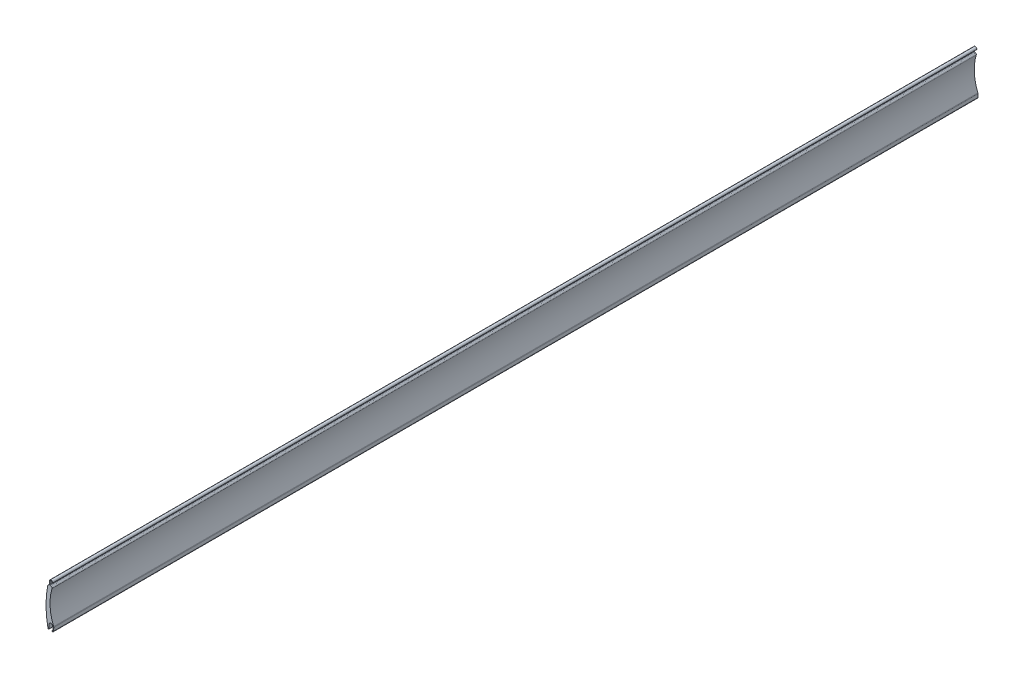
ISO-10303-21;
HEADER;
FILE_DESCRIPTION(('STEP AP214'),'2;1');
FILE_NAME('part.step','',(''),(''),'','','');
FILE_SCHEMA(('AUTOMOTIVE_DESIGN { 1 0 10303 214 1 1 1 1 }'));
ENDSEC;
DATA;
#1=APPLICATION_CONTEXT('core data for automotive mechanical design processes');
#2=APPLICATION_PROTOCOL_DEFINITION('international standard','automotive_design',2000,#1);
#3=PRODUCT_CONTEXT('',#1,'mechanical');
#4=PRODUCT('Part','Part','',(#3));
#5=PRODUCT_RELATED_PRODUCT_CATEGORY('part','',(#4));
#6=PRODUCT_DEFINITION_FORMATION('','',#4);
#7=PRODUCT_DEFINITION_CONTEXT('part definition',#1,'design');
#8=PRODUCT_DEFINITION('design','',#6,#7);
#9=PRODUCT_DEFINITION_SHAPE('','',#8);
#10=(LENGTH_UNIT() NAMED_UNIT(*) SI_UNIT(.MILLI.,.METRE.));
#11=(NAMED_UNIT(*) PLANE_ANGLE_UNIT() SI_UNIT($,.RADIAN.));
#12=(NAMED_UNIT(*) SI_UNIT($,.STERADIAN.) SOLID_ANGLE_UNIT());
#13=UNCERTAINTY_MEASURE_WITH_UNIT(LENGTH_MEASURE(1.E-05),#10,'distance_accuracy_value','');
#14=(GEOMETRIC_REPRESENTATION_CONTEXT(3) GLOBAL_UNCERTAINTY_ASSIGNED_CONTEXT((#13)) GLOBAL_UNIT_ASSIGNED_CONTEXT((#10,
#11,#12)) REPRESENTATION_CONTEXT('',''));
#15=CARTESIAN_POINT('',(0.,0.,0.));
#16=DIRECTION('',(0.,0.,1.));
#17=DIRECTION('',(1.,0.,0.));
#18=AXIS2_PLACEMENT_3D('',#15,#16,#17);
#19=CARTESIAN_POINT('',(-1.24379451788858,-0.477095883177836,-885.));
#20=DIRECTION('',(0.,0.,1.));
#21=DIRECTION('',(1.,0.,0.));
#22=AXIS2_PLACEMENT_3D('',#19,#20,#21);
#23=CYLINDRICAL_SURFACE('',#22,0.535894472984347);
#24=CARTESIAN_POINT('',(-1.24379451788858,-0.477095883177836,0.));
#25=DIRECTION('',(0.,0.,1.));
#26=DIRECTION('',(1.,0.,0.));
#27=AXIS2_PLACEMENT_3D('',#24,#25,#26);
#28=CIRCLE('',#27,0.535894472984347);
#29=CARTESIAN_POINT('',(-1.76840947033643,-0.586466984677828,0.));
#30=VERTEX_POINT('',#29);
#31=CARTESIAN_POINT('',(-0.708129005284427,-0.492759368795541,0.));
#32=VERTEX_POINT('',#31);
#33=EDGE_CURVE('E271',#30,#32,#28,.T.);
#34=ORIENTED_EDGE('',*,*,#33,.F.);
#35=DIRECTION('',(0.,0.,1.));
#36=VECTOR('',#35,1.);
#37=CARTESIAN_POINT('',(-1.76840947033643,-0.586466984677828,-885.));
#38=LINE('',#37,#36);
#39=CARTESIAN_POINT('',(-1.76840947033643,-0.586466984677828,-885.));
#40=VERTEX_POINT('',#39);
#41=EDGE_CURVE('E44',#40,#30,#38,.T.);
#42=ORIENTED_EDGE('',*,*,#41,.F.);
#43=CARTESIAN_POINT('',(-1.24379451788858,-0.477095883177836,-885.));
#44=DIRECTION('',(0.,0.,1.));
#45=DIRECTION('',(1.,0.,0.));
#46=AXIS2_PLACEMENT_3D('',#43,#44,#45);
#47=CIRCLE('',#46,0.535894472984347);
#48=CARTESIAN_POINT('',(-0.708129005284427,-0.492759368795541,-885.));
#49=VERTEX_POINT('',#48);
#50=EDGE_CURVE('E214',#40,#49,#47,.T.);
#51=ORIENTED_EDGE('',*,*,#50,.T.);
#52=DIRECTION('',(0.,0.,1.));
#53=VECTOR('',#52,1.);
#54=CARTESIAN_POINT('',(-0.708129005284427,-0.492759368795541,-885.));
#55=LINE('',#54,#53);
#56=EDGE_CURVE('E11',#49,#32,#55,.T.);
#57=ORIENTED_EDGE('',*,*,#56,.T.);
#58=EDGE_LOOP('',(#34,#42,#51,#57));
#59=FACE_BOUND('',#58,.T.);
#60=ADVANCED_FACE('F35',(#59),#23,.T.);
#61=CARTESIAN_POINT('',(86.0633469853701,17.7240086702681,-885.));
#62=DIRECTION('',(0.,0.,1.));
#63=DIRECTION('',(1.,0.,0.));
#64=AXIS2_PLACEMENT_3D('',#61,#62,#63);
#65=CYLINDRICAL_SURFACE('',#64,89.7200700000001);
#66=CARTESIAN_POINT('',(86.0633469853701,17.7240086702681,0.));
#67=DIRECTION('',(0.,0.,1.));
#68=DIRECTION('',(1.,0.,0.));
#69=AXIS2_PLACEMENT_3D('',#66,#67,#68);
#70=CIRCLE('',#69,89.7200700000001);
#71=CARTESIAN_POINT('',(-1.98617167665066,34.9569197473721,0.));
#72=VERTEX_POINT('',#71);
#73=EDGE_CURVE('E268',#72,#30,#70,.T.);
#74=ORIENTED_EDGE('',*,*,#73,.F.);
#75=DIRECTION('',(0.,0.,1.));
#76=VECTOR('',#75,1.);
#77=CARTESIAN_POINT('',(-1.98617167665066,34.9569197473721,-885.));
#78=LINE('',#77,#76);
#79=CARTESIAN_POINT('',(-1.98617167665066,34.9569197473721,-885.));
#80=VERTEX_POINT('',#79);
#81=EDGE_CURVE('E193',#80,#72,#78,.T.);
#82=ORIENTED_EDGE('',*,*,#81,.F.);
#83=CARTESIAN_POINT('',(86.0633469853701,17.7240086702681,-885.));
#84=DIRECTION('',(0.,0.,1.));
#85=DIRECTION('',(1.,0.,0.));
#86=AXIS2_PLACEMENT_3D('',#83,#84,#85);
#87=CIRCLE('',#86,89.7200700000001);
#88=EDGE_CURVE('E204',#80,#40,#87,.T.);
#89=ORIENTED_EDGE('',*,*,#88,.T.);
#90=ORIENTED_EDGE('',*,*,#41,.T.);
#91=EDGE_LOOP('',(#74,#82,#89,#90));
#92=FACE_BOUND('',#91,.T.);
#93=ADVANCED_FACE('F484',(#92),#65,.T.);
#94=CARTESIAN_POINT('',(-1.39734343266762,34.8416752286778,-885.));
#95=DIRECTION('',(0.,0.,1.));
#96=DIRECTION('',(1.,0.,0.));
#97=AXIS2_PLACEMENT_3D('',#94,#95,#96);
#98=CYLINDRICAL_SURFACE('',#97,0.600000000000614);
#99=CARTESIAN_POINT('',(-1.39734343266762,34.8416752286778,0.));
#100=DIRECTION('',(0.,0.,1.));
#101=DIRECTION('',(1.,0.,0.));
#102=AXIS2_PLACEMENT_3D('',#99,#100,#101);
#103=CIRCLE('',#102,0.600000000000614);
#104=CARTESIAN_POINT('',(-1.58598815489791,35.4112480236526,0.));
#105=VERTEX_POINT('',#104);
#106=EDGE_CURVE('E188',#105,#72,#103,.T.);
#107=ORIENTED_EDGE('',*,*,#106,.F.);
#108=DIRECTION('',(0.,0.,1.));
#109=VECTOR('',#108,1.);
#110=CARTESIAN_POINT('',(-1.58598815489791,35.4112480236526,-885.));
#111=LINE('',#110,#109);
#112=CARTESIAN_POINT('',(-1.58598815489791,35.4112480236526,-885.));
#113=VERTEX_POINT('',#112);
#114=EDGE_CURVE('E183',#113,#105,#111,.T.);
#115=ORIENTED_EDGE('',*,*,#114,.F.);
#116=CARTESIAN_POINT('',(-1.39734343266762,34.8416752286778,-885.));
#117=DIRECTION('',(0.,0.,1.));
#118=DIRECTION('',(1.,0.,0.));
#119=AXIS2_PLACEMENT_3D('',#116,#117,#118);
#120=CIRCLE('',#119,0.600000000000614);
#121=EDGE_CURVE('E186',#113,#80,#120,.T.);
#122=ORIENTED_EDGE('',*,*,#121,.T.);
#123=ORIENTED_EDGE('',*,*,#81,.T.);
#124=EDGE_LOOP('',(#107,#115,#122,#123));
#125=FACE_BOUND('',#124,.T.);
#126=ADVANCED_FACE('F185',(#125),#98,.T.);
#127=CARTESIAN_POINT('',(-1.58598815489778,35.4112480236522,-885.));
#128=DIRECTION('',(-0.314406715035243,0.949288374278726,0.));
#129=DIRECTION('',(-0.949288374278726,-0.314406715035243,0.));
#130=AXIS2_PLACEMENT_3D('',#127,#128,#129);
#131=PLANE('',#130);
#132=DIRECTION('',(-0.949288374278726,-0.314406715035243,0.));
#133=VECTOR('',#132,1.);
#134=CARTESIAN_POINT('',(-1.58598815489778,35.4112480236522,0.));
#135=LINE('',#134,#133);
#136=CARTESIAN_POINT('',(-1.04469942193401,35.5905242236226,0.));
#137=VERTEX_POINT('',#136);
#138=EDGE_CURVE('E265',#137,#105,#135,.T.);
#139=ORIENTED_EDGE('',*,*,#138,.F.);
#140=DIRECTION('',(0.,0.,1.));
#141=VECTOR('',#140,1.);
#142=CARTESIAN_POINT('',(-1.04469942193401,35.5905242236226,-885.));
#143=LINE('',#142,#141);
#144=CARTESIAN_POINT('',(-1.04469942193401,35.5905242236226,-885.));
#145=VERTEX_POINT('',#144);
#146=EDGE_CURVE('E194',#145,#137,#143,.T.);
#147=ORIENTED_EDGE('',*,*,#146,.F.);
#148=DIRECTION('',(-0.949288374278726,-0.314406715035243,0.));
#149=VECTOR('',#148,1.);
#150=CARTESIAN_POINT('',(-1.58598815489778,35.4112480236522,-885.));
#151=LINE('',#150,#149);
#152=EDGE_CURVE('E202',#145,#113,#151,.T.);
#153=ORIENTED_EDGE('',*,*,#152,.T.);
#154=ORIENTED_EDGE('',*,*,#114,.T.);
#155=EDGE_LOOP('',(#139,#147,#153,#154));
#156=FACE_BOUND('',#155,.T.);
#157=ADVANCED_FACE('F206',(#156),#131,.T.);
#158=CARTESIAN_POINT('',(-1.27695444942009,36.2917689431343,-885.));
#159=DIRECTION('',(0.,0.,1.));
#160=DIRECTION('',(1.,0.,0.));
#161=AXIS2_PLACEMENT_3D('',#158,#159,#160);
#162=CYLINDRICAL_SURFACE('',#161,0.738705999999331);
#163=CARTESIAN_POINT('',(-1.27695444942009,36.2917689431343,0.));
#164=DIRECTION('',(0.,0.,-1.));
#165=DIRECTION('',(1.,0.,0.));
#166=AXIS2_PLACEMENT_3D('',#163,#164,#165);
#167=CIRCLE('',#166,0.738705999999331);
#168=CARTESIAN_POINT('',(-0.538564027254849,36.2701786932598,0.));
#169=VERTEX_POINT('',#168);
#170=EDGE_CURVE('E262',#169,#137,#167,.T.);
#171=ORIENTED_EDGE('',*,*,#170,.F.);
#172=DIRECTION('',(0.,0.,1.));
#173=VECTOR('',#172,1.);
#174=CARTESIAN_POINT('',(-0.538564027254849,36.2701786932598,-885.));
#175=LINE('',#174,#173);
#176=CARTESIAN_POINT('',(-0.538564027254849,36.2701786932598,-885.));
#177=VERTEX_POINT('',#176);
#178=EDGE_CURVE('E278',#177,#169,#175,.T.);
#179=ORIENTED_EDGE('',*,*,#178,.F.);
#180=CARTESIAN_POINT('',(-1.27695444942009,36.2917689431343,-885.));
#181=DIRECTION('',(0.,0.,-1.));
#182=DIRECTION('',(1.,0.,0.));
#183=AXIS2_PLACEMENT_3D('',#180,#181,#182);
#184=CIRCLE('',#183,0.738705999999331);
#185=EDGE_CURVE('E207',#177,#145,#184,.T.);
#186=ORIENTED_EDGE('',*,*,#185,.T.);
#187=ORIENTED_EDGE('',*,*,#146,.T.);
#188=EDGE_LOOP('',(#171,#179,#186,#187));
#189=FACE_BOUND('',#188,.T.);
#190=ADVANCED_FACE('F486',(#189),#162,.F.);
#191=CARTESIAN_POINT('',(-0.538564027255268,36.2701786932598,-885.));
#192=DIRECTION('',(-0.999572740847055,0.029229022486317,0.));
#193=DIRECTION('',(-0.029229022486317,-0.999572740847055,0.));
#194=AXIS2_PLACEMENT_3D('',#191,#192,#193);
#195=PLANE('',#194);
#196=DIRECTION('',(-0.029229022486317,-0.999572740847055,0.));
#197=VECTOR('',#196,1.);
#198=CARTESIAN_POINT('',(-0.538564027255268,36.2701786932598,0.));
#199=LINE('',#198,#197);
#200=CARTESIAN_POINT('',(-0.44875936816689,39.3413142150799,0.));
#201=VERTEX_POINT('',#200);
#202=EDGE_CURVE('E259',#201,#169,#199,.T.);
#203=ORIENTED_EDGE('',*,*,#202,.F.);
#204=DIRECTION('',(0.,0.,1.));
#205=VECTOR('',#204,1.);
#206=CARTESIAN_POINT('',(-0.44875936816689,39.3413142150799,-885.));
#207=LINE('',#206,#205);
#208=CARTESIAN_POINT('',(-0.44875936816689,39.3413142150799,-885.));
#209=VERTEX_POINT('',#208);
#210=EDGE_CURVE('E280',#209,#201,#207,.T.);
#211=ORIENTED_EDGE('',*,*,#210,.F.);
#212=DIRECTION('',(-0.029229022486317,-0.999572740847055,0.));
#213=VECTOR('',#212,1.);
#214=CARTESIAN_POINT('',(-0.538564027255268,36.2701786932598,-885.));
#215=LINE('',#214,#213);
#216=EDGE_CURVE('E209',#209,#177,#215,.T.);
#217=ORIENTED_EDGE('',*,*,#216,.T.);
#218=ORIENTED_EDGE('',*,*,#178,.T.);
#219=EDGE_LOOP('',(#203,#211,#217,#218));
#220=FACE_BOUND('',#219,.T.);
#221=ADVANCED_FACE('F391',(#220),#195,.T.);
#222=CARTESIAN_POINT('',(1.15053552694845,39.2938134022761,-885.));
#223=DIRECTION('',(0.,0.,1.));
#224=DIRECTION('',(1.,0.,0.));
#225=AXIS2_PLACEMENT_3D('',#222,#223,#224);
#226=CYLINDRICAL_SURFACE('',#225,1.60000015273601);
#227=CARTESIAN_POINT('',(1.15053552694845,39.2938134022761,0.));
#228=DIRECTION('',(0.,0.,1.));
#229=DIRECTION('',(1.,0.,0.));
#230=AXIS2_PLACEMENT_3D('',#227,#228,#229);
#231=CIRCLE('',#230,1.60000015273601);
#232=CARTESIAN_POINT('',(2.74987336620641,39.2477811888497,0.));
#233=VERTEX_POINT('',#232);
#234=EDGE_CURVE('E256',#233,#201,#231,.T.);
#235=ORIENTED_EDGE('',*,*,#234,.F.);
#236=DIRECTION('',(0.,0.,1.));
#237=VECTOR('',#236,1.);
#238=CARTESIAN_POINT('',(2.74987336620641,39.2477811888497,-885.));
#239=LINE('',#238,#237);
#240=CARTESIAN_POINT('',(2.74987336620641,39.2477811888497,-885.));
#241=VERTEX_POINT('',#240);
#242=EDGE_CURVE('E282',#241,#233,#239,.T.);
#243=ORIENTED_EDGE('',*,*,#242,.F.);
#244=CARTESIAN_POINT('',(1.15053552694845,39.2938134022761,-885.));
#245=DIRECTION('',(0.,0.,1.));
#246=DIRECTION('',(1.,0.,0.));
#247=AXIS2_PLACEMENT_3D('',#244,#245,#246);
#248=CIRCLE('',#247,1.60000015273601);
#249=EDGE_CURVE('E385',#241,#209,#248,.T.);
#250=ORIENTED_EDGE('',*,*,#249,.T.);
#251=ORIENTED_EDGE('',*,*,#210,.T.);
#252=EDGE_LOOP('',(#235,#243,#250,#251));
#253=FACE_BOUND('',#252,.T.);
#254=ADVANCED_FACE('F397',(#253),#226,.T.);
#255=CARTESIAN_POINT('',(2.30006569853119,39.2609364957856,-885.));
#256=DIRECTION('',(0.,0.,1.));
#257=DIRECTION('',(1.,0.,0.));
#258=AXIS2_PLACEMENT_3D('',#255,#256,#257);
#259=CYLINDRICAL_SURFACE('',#258,0.449999999999965);
#260=CARTESIAN_POINT('',(2.30006569853119,39.2609364957856,0.));
#261=DIRECTION('',(0.,0.,1.));
#262=DIRECTION('',(1.,0.,0.));
#263=AXIS2_PLACEMENT_3D('',#260,#261,#262);
#264=CIRCLE('',#263,0.449999999999965);
#265=CARTESIAN_POINT('',(1.87808462843638,39.1046291815562,0.));
#266=VERTEX_POINT('',#265);
#267=EDGE_CURVE('E253',#266,#233,#264,.T.);
#268=ORIENTED_EDGE('',*,*,#267,.F.);
#269=DIRECTION('',(0.,0.,1.));
#270=VECTOR('',#269,1.);
#271=CARTESIAN_POINT('',(1.87808462843638,39.1046291815562,-885.));
#272=LINE('',#271,#270);
#273=CARTESIAN_POINT('',(1.87808462843638,39.1046291815562,-885.));
#274=VERTEX_POINT('',#273);
#275=EDGE_CURVE('E284',#274,#266,#272,.T.);
#276=ORIENTED_EDGE('',*,*,#275,.F.);
#277=CARTESIAN_POINT('',(2.30006569853119,39.2609364957856,-885.));
#278=DIRECTION('',(0.,0.,1.));
#279=DIRECTION('',(1.,0.,0.));
#280=AXIS2_PLACEMENT_3D('',#277,#278,#279);
#281=CIRCLE('',#280,0.449999999999965);
#282=EDGE_CURVE('E382',#274,#241,#281,.T.);
#283=ORIENTED_EDGE('',*,*,#282,.T.);
#284=ORIENTED_EDGE('',*,*,#242,.T.);
#285=EDGE_LOOP('',(#268,#276,#283,#284));
#286=FACE_BOUND('',#285,.T.);
#287=ADVANCED_FACE('F400',(#286),#259,.T.);
#288=CARTESIAN_POINT('',(1.87808462843531,39.1046291815558,-885.));
#289=DIRECTION('',(-0.50914796465507,0.860679005255501,0.));
#290=DIRECTION('',(-0.860679005255501,-0.509147964655071,0.));
#291=AXIS2_PLACEMENT_3D('',#288,#289,#290);
#292=PLANE('',#291);
#293=DIRECTION('',(-0.860679005255501,-0.509147964655071,0.));
#294=VECTOR('',#293,1.);
#295=CARTESIAN_POINT('',(1.87808462843531,39.1046291815558,0.));
#296=LINE('',#295,#294);
#297=CARTESIAN_POINT('',(2.14975363073907,39.2653391776615,0.));
#298=VERTEX_POINT('',#297);
#299=EDGE_CURVE('E250',#298,#266,#296,.T.);
#300=ORIENTED_EDGE('',*,*,#299,.F.);
#301=DIRECTION('',(0.,0.,1.));
#302=VECTOR('',#301,1.);
#303=CARTESIAN_POINT('',(2.14975363073907,39.2653391776615,-885.));
#304=LINE('',#303,#302);
#305=CARTESIAN_POINT('',(2.14975363073907,39.2653391776615,-885.));
#306=VERTEX_POINT('',#305);
#307=EDGE_CURVE('E286',#306,#298,#304,.T.);
#308=ORIENTED_EDGE('',*,*,#307,.F.);
#309=DIRECTION('',(-0.860679005255501,-0.509147964655071,0.));
#310=VECTOR('',#309,1.);
#311=CARTESIAN_POINT('',(1.87808462843531,39.1046291815558,-885.));
#312=LINE('',#311,#310);
#313=EDGE_CURVE('E379',#306,#274,#312,.T.);
#314=ORIENTED_EDGE('',*,*,#313,.T.);
#315=ORIENTED_EDGE('',*,*,#275,.T.);
#316=EDGE_LOOP('',(#300,#308,#314,#315));
#317=FACE_BOUND('',#316,.T.);
#318=ADVANCED_FACE('F405',(#317),#292,.T.);
#319=CARTESIAN_POINT('',(1.15054378360884,39.294111087081,-885.));
#320=DIRECTION('',(0.,0.,1.));
#321=DIRECTION('',(1.,0.,0.));
#322=AXIS2_PLACEMENT_3D('',#319,#320,#321);
#323=CYLINDRICAL_SURFACE('',#322,0.999624000000001);
#324=CARTESIAN_POINT('',(1.15054378360884,39.294111087081,0.));
#325=DIRECTION('',(0.,0.,-1.));
#326=DIRECTION('',(1.,0.,0.));
#327=AXIS2_PLACEMENT_3D('',#324,#325,#326);
#328=CIRCLE('',#327,0.999624000000001);
#329=CARTESIAN_POINT('',(0.151359724890613,39.3237650611715,0.));
#330=VERTEX_POINT('',#329);
#331=EDGE_CURVE('E247',#330,#298,#328,.T.);
#332=ORIENTED_EDGE('',*,*,#331,.F.);
#333=DIRECTION('',(0.,0.,1.));
#334=VECTOR('',#333,1.);
#335=CARTESIAN_POINT('',(0.151359724890613,39.3237650611715,-885.));
#336=LINE('',#335,#334);
#337=CARTESIAN_POINT('',(0.151359724890613,39.3237650611715,-885.));
#338=VERTEX_POINT('',#337);
#339=EDGE_CURVE('E288',#338,#330,#336,.T.);
#340=ORIENTED_EDGE('',*,*,#339,.F.);
#341=CARTESIAN_POINT('',(1.15054378360884,39.294111087081,-885.));
#342=DIRECTION('',(0.,0.,-1.));
#343=DIRECTION('',(1.,0.,0.));
#344=AXIS2_PLACEMENT_3D('',#341,#342,#343);
#345=CIRCLE('',#344,0.999624000000001);
#346=EDGE_CURVE('E376',#338,#306,#345,.T.);
#347=ORIENTED_EDGE('',*,*,#346,.T.);
#348=ORIENTED_EDGE('',*,*,#307,.T.);
#349=EDGE_LOOP('',(#332,#340,#347,#348));
#350=FACE_BOUND('',#349,.T.);
#351=ADVANCED_FACE('F408',(#350),#323,.F.);
#352=CARTESIAN_POINT('',(0.151359724889442,39.3237650611716,-885.));
#353=DIRECTION('',(0.999572749210783,-0.0292287364625663,0.));
#354=DIRECTION('',(0.0292287364625663,0.999572749210783,0.));
#355=AXIS2_PLACEMENT_3D('',#352,#353,#354);
#356=PLANE('',#355);
#357=DIRECTION('',(0.0292287364625663,0.999572749210783,0.));
#358=VECTOR('',#357,1.);
#359=CARTESIAN_POINT('',(0.151359724889442,39.3237650611716,0.));
#360=LINE('',#359,#358);
#361=CARTESIAN_POINT('',(0.072230592785257,36.6176842074425,0.));
#362=VERTEX_POINT('',#361);
#363=EDGE_CURVE('E244',#362,#330,#360,.T.);
#364=ORIENTED_EDGE('',*,*,#363,.F.);
#365=DIRECTION('',(0.,0.,1.));
#366=VECTOR('',#365,1.);
#367=CARTESIAN_POINT('',(0.072230592785257,36.6176842074425,-885.));
#368=LINE('',#367,#366);
#369=CARTESIAN_POINT('',(0.072230592785257,36.6176842074425,-885.));
#370=VERTEX_POINT('',#369);
#371=EDGE_CURVE('E290',#370,#362,#368,.T.);
#372=ORIENTED_EDGE('',*,*,#371,.F.);
#373=DIRECTION('',(0.0292287364625663,0.999572749210783,0.));
#374=VECTOR('',#373,1.);
#375=CARTESIAN_POINT('',(0.151359724889442,39.3237650611716,-885.));
#376=LINE('',#375,#374);
#377=EDGE_CURVE('E373',#370,#338,#376,.T.);
#378=ORIENTED_EDGE('',*,*,#377,.T.);
#379=ORIENTED_EDGE('',*,*,#339,.T.);
#380=EDGE_LOOP('',(#364,#372,#378,#379));
#381=FACE_BOUND('',#380,.T.);
#382=ADVANCED_FACE('F413',(#381),#356,.T.);
#383=CARTESIAN_POINT('',(0.671974223128206,36.6001463094964,-885.));
#384=DIRECTION('',(0.,0.,1.));
#385=DIRECTION('',(1.,0.,0.));
#386=AXIS2_PLACEMENT_3D('',#383,#384,#385);
#387=CYLINDRICAL_SURFACE('',#386,0.600000000000727);
#388=CARTESIAN_POINT('',(0.671974223128206,36.6001463094964,0.));
#389=DIRECTION('',(0.,0.,-1.));
#390=DIRECTION('',(1.,0.,0.));
#391=AXIS2_PLACEMENT_3D('',#388,#389,#390);
#392=CIRCLE('',#391,0.600000000000727);
#393=CARTESIAN_POINT('',(0.499809768408062,36.0253773119575,0.));
#394=VERTEX_POINT('',#393);
#395=EDGE_CURVE('E241',#394,#362,#392,.T.);
#396=ORIENTED_EDGE('',*,*,#395,.F.);
#397=DIRECTION('',(0.,0.,1.));
#398=VECTOR('',#397,1.);
#399=CARTESIAN_POINT('',(0.499809768408062,36.0253773119575,-885.));
#400=LINE('',#399,#398);
#401=CARTESIAN_POINT('',(0.499809768408062,36.0253773119575,-885.));
#402=VERTEX_POINT('',#401);
#403=EDGE_CURVE('E292',#402,#394,#400,.T.);
#404=ORIENTED_EDGE('',*,*,#403,.F.);
#405=CARTESIAN_POINT('',(0.671974223128206,36.6001463094964,-885.));
#406=DIRECTION('',(0.,0.,-1.));
#407=DIRECTION('',(1.,0.,0.));
#408=AXIS2_PLACEMENT_3D('',#405,#406,#407);
#409=CIRCLE('',#408,0.600000000000727);
#410=EDGE_CURVE('E370',#402,#370,#409,.T.);
#411=ORIENTED_EDGE('',*,*,#410,.T.);
#412=ORIENTED_EDGE('',*,*,#371,.T.);
#413=EDGE_LOOP('',(#396,#404,#411,#412));
#414=FACE_BOUND('',#413,.T.);
#415=ADVANCED_FACE('F416',(#414),#387,.F.);
#416=CARTESIAN_POINT('',(0.499809768408168,36.0253773119579,-885.));
#417=DIRECTION('',(0.286941123245532,0.9579482197857,0.));
#418=DIRECTION('',(-0.9579482197857,0.286941123245532,0.));
#419=AXIS2_PLACEMENT_3D('',#416,#417,#418);
#420=PLANE('',#419);
#421=DIRECTION('',(-0.957948219785701,0.286941123245532,0.));
#422=VECTOR('',#421,1.);
#423=CARTESIAN_POINT('',(0.499809768408168,36.0253773119579,0.));
#424=LINE('',#423,#422);
#425=CARTESIAN_POINT('',(1.26151858102397,35.7972171903942,0.));
#426=VERTEX_POINT('',#425);
#427=EDGE_CURVE('E238',#426,#394,#424,.T.);
#428=ORIENTED_EDGE('',*,*,#427,.F.);
#429=DIRECTION('',(0.,0.,1.));
#430=VECTOR('',#429,1.);
#431=CARTESIAN_POINT('',(1.26151858102397,35.7972171903942,-885.));
#432=LINE('',#431,#430);
#433=CARTESIAN_POINT('',(1.26151858102397,35.7972171903942,-885.));
#434=VERTEX_POINT('',#433);
#435=EDGE_CURVE('E294',#434,#426,#432,.T.);
#436=ORIENTED_EDGE('',*,*,#435,.F.);
#437=DIRECTION('',(-0.957948219785701,0.286941123245532,0.));
#438=VECTOR('',#437,1.);
#439=CARTESIAN_POINT('',(0.499809768408168,36.0253773119579,-885.));
#440=LINE('',#439,#438);
#441=EDGE_CURVE('E367',#434,#402,#440,.T.);
#442=ORIENTED_EDGE('',*,*,#441,.T.);
#443=ORIENTED_EDGE('',*,*,#403,.T.);
#444=EDGE_LOOP('',(#428,#436,#442,#443));
#445=FACE_BOUND('',#444,.T.);
#446=ADVANCED_FACE('F421',(#445),#420,.T.);
#447=CARTESIAN_POINT('',(0.902841573279517,34.5997821446019,-885.));
#448=DIRECTION('',(0.,0.,1.));
#449=DIRECTION('',(1.,0.,0.));
#450=AXIS2_PLACEMENT_3D('',#447,#448,#449);
#451=CYLINDRICAL_SURFACE('',#450,1.24999995391014);
#452=CARTESIAN_POINT('',(0.902841573279517,34.5997821446019,0.));
#453=DIRECTION('',(0.,0.,1.));
#454=DIRECTION('',(1.,0.,0.));
#455=AXIS2_PLACEMENT_3D('',#452,#453,#454);
#456=CIRCLE('',#455,1.24999995391014);
#457=CARTESIAN_POINT('',(2.10077310899599,34.2427668500957,0.));
#458=VERTEX_POINT('',#457);
#459=EDGE_CURVE('E235',#458,#426,#456,.T.);
#460=ORIENTED_EDGE('',*,*,#459,.F.);
#461=DIRECTION('',(0.,0.,1.));
#462=VECTOR('',#461,1.);
#463=CARTESIAN_POINT('',(2.10077310899599,34.2427668500957,-885.));
#464=LINE('',#463,#462);
#465=CARTESIAN_POINT('',(2.10077310899599,34.2427668500957,-885.));
#466=VERTEX_POINT('',#465);
#467=EDGE_CURVE('E296',#466,#458,#464,.T.);
#468=ORIENTED_EDGE('',*,*,#467,.F.);
#469=CARTESIAN_POINT('',(0.902841573279517,34.5997821446019,-885.));
#470=DIRECTION('',(0.,0.,1.));
#471=DIRECTION('',(1.,0.,0.));
#472=AXIS2_PLACEMENT_3D('',#469,#470,#471);
#473=CIRCLE('',#472,1.24999995391014);
#474=EDGE_CURVE('E364',#466,#434,#473,.T.);
#475=ORIENTED_EDGE('',*,*,#474,.T.);
#476=ORIENTED_EDGE('',*,*,#435,.T.);
#477=EDGE_LOOP('',(#460,#468,#475,#476));
#478=FACE_BOUND('',#477,.T.);
#479=ADVANCED_FACE('F424',(#478),#451,.T.);
#480=CARTESIAN_POINT('',(46.1953973129679,21.1014265152838,-885.));
#481=DIRECTION('',(0.,0.,1.));
#482=DIRECTION('',(1.,0.,0.));
#483=AXIS2_PLACEMENT_3D('',#480,#481,#482);
#484=CYLINDRICAL_SURFACE('',#483,46.0112020000005);
#485=CARTESIAN_POINT('',(46.1953973129679,21.1014265152838,0.));
#486=DIRECTION('',(0.,0.,-1.));
#487=DIRECTION('',(1.,0.,0.));
#488=AXIS2_PLACEMENT_3D('',#485,#486,#487);
#489=CIRCLE('',#488,46.0112020000005);
#490=CARTESIAN_POINT('',(3.66734560033938,3.5402327343119,0.));
#491=VERTEX_POINT('',#490);
#492=EDGE_CURVE('E232',#491,#458,#489,.T.);
#493=ORIENTED_EDGE('',*,*,#492,.F.);
#494=DIRECTION('',(0.,0.,1.));
#495=VECTOR('',#494,1.);
#496=CARTESIAN_POINT('',(3.66734560033938,3.5402327343119,-885.));
#497=LINE('',#496,#495);
#498=CARTESIAN_POINT('',(3.66734560033938,3.5402327343119,-885.));
#499=VERTEX_POINT('',#498);
#500=EDGE_CURVE('E298',#499,#491,#497,.T.);
#501=ORIENTED_EDGE('',*,*,#500,.F.);
#502=CARTESIAN_POINT('',(46.1953973129679,21.1014265152838,-885.));
#503=DIRECTION('',(0.,0.,-1.));
#504=DIRECTION('',(1.,0.,0.));
#505=AXIS2_PLACEMENT_3D('',#502,#503,#504);
#506=CIRCLE('',#505,46.0112020000005);
#507=EDGE_CURVE('E361',#499,#466,#506,.T.);
#508=ORIENTED_EDGE('',*,*,#507,.T.);
#509=ORIENTED_EDGE('',*,*,#467,.T.);
#510=EDGE_LOOP('',(#493,#501,#508,#509));
#511=FACE_BOUND('',#510,.T.);
#512=ADVANCED_FACE('F429',(#511),#484,.F.);
#513=CARTESIAN_POINT('',(2.18846954027293,2.92955667681263,-885.));
#514=DIRECTION('',(0.,0.,1.));
#515=DIRECTION('',(1.,0.,0.));
#516=AXIS2_PLACEMENT_3D('',#513,#514,#515);
#517=CYLINDRICAL_SURFACE('',#516,1.5999998900756);
#518=CARTESIAN_POINT('',(2.18846954027293,2.92955667681263,0.));
#519=DIRECTION('',(0.,0.,1.));
#520=DIRECTION('',(1.,0.,0.));
#521=AXIS2_PLACEMENT_3D('',#518,#519,#520);
#522=CIRCLE('',#521,1.5999998900756);
#523=CARTESIAN_POINT('',(3.78778584032523,2.88279108445086,0.));
#524=VERTEX_POINT('',#523);
#525=EDGE_CURVE('E229',#524,#491,#522,.T.);
#526=ORIENTED_EDGE('',*,*,#525,.F.);
#527=DIRECTION('',(0.,0.,1.));
#528=VECTOR('',#527,1.);
#529=CARTESIAN_POINT('',(3.78778584032523,2.88279108445086,-885.));
#530=LINE('',#529,#528);
#531=CARTESIAN_POINT('',(3.78778584032523,2.88279108445086,-885.));
#532=VERTEX_POINT('',#531);
#533=EDGE_CURVE('E300',#532,#524,#530,.T.);
#534=ORIENTED_EDGE('',*,*,#533,.F.);
#535=CARTESIAN_POINT('',(2.18846954027293,2.92955667681263,-885.));
#536=DIRECTION('',(0.,0.,1.));
#537=DIRECTION('',(1.,0.,0.));
#538=AXIS2_PLACEMENT_3D('',#535,#536,#537);
#539=CIRCLE('',#538,1.5999998900756);
#540=EDGE_CURVE('E358',#532,#499,#539,.T.);
#541=ORIENTED_EDGE('',*,*,#540,.T.);
#542=ORIENTED_EDGE('',*,*,#500,.T.);
#543=EDGE_LOOP('',(#526,#534,#541,#542));
#544=FACE_BOUND('',#543,.T.);
#545=ADVANCED_FACE('F432',(#544),#517,.T.);
#546=CARTESIAN_POINT('',(3.78778584032523,2.88279108445086,-885.));
#547=DIRECTION('',(0.999572745154882,-0.0292288751670996,0.));
#548=DIRECTION('',(0.0292288751670996,0.999572745154882,0.));
#549=AXIS2_PLACEMENT_3D('',#546,#547,#548);
#550=PLANE('',#549);
#551=DIRECTION('',(0.0292288751670996,0.999572745154882,0.));
#552=VECTOR('',#551,1.);
#553=CARTESIAN_POINT('',(3.78778584032523,2.88279108445086,0.));
#554=LINE('',#553,#552);
#555=CARTESIAN_POINT('',(3.69863779662254,-0.165904914271209,0.));
#556=VERTEX_POINT('',#555);
#557=EDGE_CURVE('E226',#556,#524,#554,.T.);
#558=ORIENTED_EDGE('',*,*,#557,.F.);
#559=DIRECTION('',(0.,0.,1.));
#560=VECTOR('',#559,1.);
#561=CARTESIAN_POINT('',(3.69863779662254,-0.165904914271209,-885.));
#562=LINE('',#561,#560);
#563=CARTESIAN_POINT('',(3.69863779662254,-0.165904914271209,-885.));
#564=VERTEX_POINT('',#563);
#565=EDGE_CURVE('E302',#564,#556,#562,.T.);
#566=ORIENTED_EDGE('',*,*,#565,.F.);
#567=DIRECTION('',(0.0292288751670996,0.999572745154882,0.));
#568=VECTOR('',#567,1.);
#569=CARTESIAN_POINT('',(3.78778584032523,2.88279108445086,-885.));
#570=LINE('',#569,#568);
#571=EDGE_CURVE('E355',#564,#532,#570,.T.);
#572=ORIENTED_EDGE('',*,*,#571,.T.);
#573=ORIENTED_EDGE('',*,*,#533,.T.);
#574=EDGE_LOOP('',(#558,#566,#572,#573));
#575=FACE_BOUND('',#574,.T.);
#576=ADVANCED_FACE('F437',(#575),#550,.T.);
#577=CARTESIAN_POINT('',(2.63099301578236,-0.134685905362015,-885.));
#578=DIRECTION('',(0.,0.,1.));
#579=DIRECTION('',(1.,0.,0.));
#580=AXIS2_PLACEMENT_3D('',#577,#578,#579);
#581=CYLINDRICAL_SURFACE('',#580,1.06810112094902);
#582=CARTESIAN_POINT('',(2.63099301578236,-0.134685905362015,0.));
#583=DIRECTION('',(0.,0.,1.));
#584=DIRECTION('',(1.,0.,0.));
#585=AXIS2_PLACEMENT_3D('',#582,#583,#584);
#586=CIRCLE('',#585,1.06810112094902);
#587=CARTESIAN_POINT('',(2.32451063511698,-1.15787139925559,0.));
#588=VERTEX_POINT('',#587);
#589=EDGE_CURVE('E223',#588,#556,#586,.T.);
#590=ORIENTED_EDGE('',*,*,#589,.F.);
#591=DIRECTION('',(0.,0.,1.));
#592=VECTOR('',#591,1.);
#593=CARTESIAN_POINT('',(2.32451063511698,-1.15787139925559,-885.));
#594=LINE('',#593,#592);
#595=CARTESIAN_POINT('',(2.32451063511698,-1.15787139925559,-885.));
#596=VERTEX_POINT('',#595);
#597=EDGE_CURVE('E303',#596,#588,#594,.T.);
#598=ORIENTED_EDGE('',*,*,#597,.F.);
#599=CARTESIAN_POINT('',(2.63099301578236,-0.134685905362015,-885.));
#600=DIRECTION('',(0.,0.,1.));
#601=DIRECTION('',(1.,0.,0.));
#602=AXIS2_PLACEMENT_3D('',#599,#600,#601);
#603=CIRCLE('',#602,1.06810112094902);
#604=EDGE_CURVE('E352',#596,#564,#603,.T.);
#605=ORIENTED_EDGE('',*,*,#604,.T.);
#606=ORIENTED_EDGE('',*,*,#565,.T.);
#607=EDGE_LOOP('',(#590,#598,#605,#606));
#608=FACE_BOUND('',#607,.T.);
#609=ADVANCED_FACE('F439',(#608),#581,.T.);
#610=CARTESIAN_POINT('',(2.17562123178466,-1.11327331326668,-885.));
#611=DIRECTION('',(-0.286942136799928,-0.957947916187875,0.));
#612=DIRECTION('',(0.957947916187875,-0.286942136799928,0.));
#613=AXIS2_PLACEMENT_3D('',#610,#611,#612);
#614=PLANE('',#613);
#615=DIRECTION('',(0.957947916187875,-0.286942136799928,0.));
#616=VECTOR('',#615,1.);
#617=CARTESIAN_POINT('',(2.17562123178466,-1.11327331326668,0.));
#618=LINE('',#617,#616);
#619=CARTESIAN_POINT('',(2.17562123178466,-1.11327331326668,0.));
#620=VERTEX_POINT('',#619);
#621=EDGE_CURVE('E219',#620,#588,#618,.T.);
#622=ORIENTED_EDGE('',*,*,#621,.F.);
#623=DIRECTION('',(0.,0.,1.));
#624=VECTOR('',#623,1.);
#625=CARTESIAN_POINT('',(2.17562123178466,-1.11327331326668,-885.));
#626=LINE('',#625,#624);
#627=CARTESIAN_POINT('',(2.17562123178466,-1.11327331326668,-885.));
#628=VERTEX_POINT('',#627);
#629=EDGE_CURVE('E39',#628,#620,#626,.T.);
#630=ORIENTED_EDGE('',*,*,#629,.F.);
#631=DIRECTION('',(0.957947916187875,-0.286942136799928,0.));
#632=VECTOR('',#631,1.);
#633=CARTESIAN_POINT('',(2.17562123178466,-1.11327331326668,-885.));
#634=LINE('',#633,#632);
#635=EDGE_CURVE('E350',#628,#596,#634,.T.);
#636=ORIENTED_EDGE('',*,*,#635,.T.);
#637=ORIENTED_EDGE('',*,*,#597,.T.);
#638=EDGE_LOOP('',(#622,#630,#636,#637));
#639=FACE_BOUND('',#638,.T.);
#640=ADVANCED_FACE('F311',(#639),#614,.T.);
#641=CARTESIAN_POINT('',(2.26176399541171,-0.825688220915001,-885.));
#642=DIRECTION('',(0.,0.,1.));
#643=DIRECTION('',(1.,0.,0.));
#644=AXIS2_PLACEMENT_3D('',#641,#642,#643);
#645=CYLINDRICAL_SURFACE('',#644,0.300209528609988);
#646=CARTESIAN_POINT('',(2.26176399541171,-0.825688220915001,0.));
#647=DIRECTION('',(0.,0.,1.));
#648=DIRECTION('',(1.,0.,0.));
#649=AXIS2_PLACEMENT_3D('',#646,#647,#648);
#650=CIRCLE('',#649,0.300209528609988);
#651=CARTESIAN_POINT('',(2.34790646497369,-0.538103040479687,0.));
#652=VERTEX_POINT('',#651);
#653=EDGE_CURVE('E216',#652,#620,#650,.T.);
#654=ORIENTED_EDGE('',*,*,#653,.F.);
#655=DIRECTION('',(0.,0.,1.));
#656=VECTOR('',#655,1.);
#657=CARTESIAN_POINT('',(2.34790646497369,-0.538103040479687,-891.972724751526));
#658=LINE('',#657,#656);
#659=CARTESIAN_POINT('',(2.34790646497369,-0.538103040479687,-885.));
#660=VERTEX_POINT('',#659);
#661=EDGE_CURVE('E336',#660,#652,#658,.T.);
#662=ORIENTED_EDGE('',*,*,#661,.F.);
#663=CARTESIAN_POINT('',(2.26176399541171,-0.825688220915001,-885.));
#664=DIRECTION('',(0.,0.,1.));
#665=DIRECTION('',(1.,0.,0.));
#666=AXIS2_PLACEMENT_3D('',#663,#664,#665);
#667=CIRCLE('',#666,0.300209528609988);
#668=EDGE_CURVE('E273',#660,#628,#667,.T.);
#669=ORIENTED_EDGE('',*,*,#668,.T.);
#670=ORIENTED_EDGE('',*,*,#629,.T.);
#671=EDGE_LOOP('',(#654,#662,#669,#670));
#672=FACE_BOUND('',#671,.T.);
#673=ADVANCED_FACE('F37',(#672),#645,.T.);
#674=CARTESIAN_POINT('',(2.26176399541171,-0.825688220915001,-885.));
#675=DIRECTION('',(0.,0.,1.));
#676=DIRECTION('',(1.,0.,0.));
#677=AXIS2_PLACEMENT_3D('',#674,#675,#676);
#678=PLANE('',#677);
#679=ORIENTED_EDGE('',*,*,#668,.F.);
#680=DIRECTION('',(-0.9579482095949,0.28694115726735,0.));
#681=VECTOR('',#680,1.);
#682=CARTESIAN_POINT('',(2.49679591390891,-0.582700974224389,-885.));
#683=LINE('',#682,#681);
#684=CARTESIAN_POINT('',(2.49679591390891,-0.582700974224389,-885.));
#685=VERTEX_POINT('',#684);
#686=EDGE_CURVE('E445',#685,#660,#683,.T.);
#687=ORIENTED_EDGE('',*,*,#686,.F.);
#688=CARTESIAN_POINT('',(2.63099301578236,-0.134685905362015,-885.));
#689=DIRECTION('',(0.,0.,1.));
#690=DIRECTION('',(1.,0.,0.));
#691=AXIS2_PLACEMENT_3D('',#688,#689,#690);
#692=CIRCLE('',#691,0.467681904801747);
#693=CARTESIAN_POINT('',(3.09847510027876,-0.148355753711124,-885.));
#694=VERTEX_POINT('',#693);
#695=EDGE_CURVE('E348',#694,#685,#692,.F.);
#696=ORIENTED_EDGE('',*,*,#695,.F.);
#697=DIRECTION('',(-0.0292288030692907,-0.999572747263118,0.));
#698=VECTOR('',#697,1.);
#699=CARTESIAN_POINT('',(3.12842291926544,0.875806050933625,-885.));
#700=LINE('',#699,#698);
#701=CARTESIAN_POINT('',(3.12842291926544,0.875806050933625,-885.));
#702=VERTEX_POINT('',#701);
#703=EDGE_CURVE('E220',#702,#694,#700,.T.);
#704=ORIENTED_EDGE('',*,*,#703,.F.);
#705=CARTESIAN_POINT('',(-3.26314609076081,1.062704067705,-885.));
#706=DIRECTION('',(0.,0.,1.));
#707=DIRECTION('',(1.,0.,0.));
#708=AXIS2_PLACEMENT_3D('',#705,#706,#707);
#709=CIRCLE('',#708,6.394301);
#710=CARTESIAN_POINT('',(2.22519559754424,4.34373908595975,-885.));
#711=VERTEX_POINT('',#710);
#712=EDGE_CURVE('E335',#711,#702,#709,.F.);
#713=ORIENTED_EDGE('',*,*,#712,.F.);
#714=CARTESIAN_POINT('',(0.925480903673204,3.56674551771112,-885.));
#715=DIRECTION('',(0.,0.,1.));
#716=DIRECTION('',(1.,0.,0.));
#717=AXIS2_PLACEMENT_3D('',#714,#715,#716);
#718=CIRCLE('',#717,1.514258);
#719=CARTESIAN_POINT('',(-0.588130108007098,3.61100606316792,-885.));
#720=VERTEX_POINT('',#719);
#721=EDGE_CURVE('E454',#720,#711,#718,.F.);
#722=ORIENTED_EDGE('',*,*,#721,.F.);
#723=DIRECTION('',(0.0292286754339459,0.999572750995333,0.));
#724=VECTOR('',#723,1.);
#725=CARTESIAN_POINT('',(-0.588130108007098,3.61100606316792,-885.));
#726=LINE('',#725,#724);
#727=EDGE_CURVE('E449',#49,#720,#726,.T.);
#728=ORIENTED_EDGE('',*,*,#727,.F.);
#729=ORIENTED_EDGE('',*,*,#50,.F.);
#730=ORIENTED_EDGE('',*,*,#88,.F.);
#731=ORIENTED_EDGE('',*,*,#121,.F.);
#732=ORIENTED_EDGE('',*,*,#152,.F.);
#733=ORIENTED_EDGE('',*,*,#185,.F.);
#734=ORIENTED_EDGE('',*,*,#216,.F.);
#735=ORIENTED_EDGE('',*,*,#249,.F.);
#736=ORIENTED_EDGE('',*,*,#282,.F.);
#737=ORIENTED_EDGE('',*,*,#313,.F.);
#738=ORIENTED_EDGE('',*,*,#346,.F.);
#739=ORIENTED_EDGE('',*,*,#377,.F.);
#740=ORIENTED_EDGE('',*,*,#410,.F.);
#741=ORIENTED_EDGE('',*,*,#441,.F.);
#742=ORIENTED_EDGE('',*,*,#474,.F.);
#743=ORIENTED_EDGE('',*,*,#507,.F.);
#744=ORIENTED_EDGE('',*,*,#540,.F.);
#745=ORIENTED_EDGE('',*,*,#571,.F.);
#746=ORIENTED_EDGE('',*,*,#604,.F.);
#747=ORIENTED_EDGE('',*,*,#635,.F.);
#748=EDGE_LOOP('',(#679,#687,#696,#704,#713,#722,#728,#729,#730,#731,#732,#733,#734,#735,#736,
#737,#738,#739,#740,#741,#742,#743,#744,#745,#746,#747));
#749=FACE_BOUND('',#748,.T.);
#750=ADVANCED_FACE('F200',(#749),#678,.F.);
#751=CARTESIAN_POINT('',(2.26176399541171,-0.825688220915001,0.));
#752=DIRECTION('',(0.,0.,1.));
#753=DIRECTION('',(1.,0.,0.));
#754=AXIS2_PLACEMENT_3D('',#751,#752,#753);
#755=PLANE('',#754);
#756=DIRECTION('',(0.9579482095949,-0.28694115726735,0.));
#757=VECTOR('',#756,1.);
#758=CARTESIAN_POINT('',(2.49679591390891,-0.582700974224389,0.));
#759=LINE('',#758,#757);
#760=CARTESIAN_POINT('',(2.49679591390891,-0.582700974224389,0.));
#761=VERTEX_POINT('',#760);
#762=EDGE_CURVE('E316',#652,#761,#759,.T.);
#763=ORIENTED_EDGE('',*,*,#762,.F.);
#764=ORIENTED_EDGE('',*,*,#653,.T.);
#765=ORIENTED_EDGE('',*,*,#621,.T.);
#766=ORIENTED_EDGE('',*,*,#589,.T.);
#767=ORIENTED_EDGE('',*,*,#557,.T.);
#768=ORIENTED_EDGE('',*,*,#525,.T.);
#769=ORIENTED_EDGE('',*,*,#492,.T.);
#770=ORIENTED_EDGE('',*,*,#459,.T.);
#771=ORIENTED_EDGE('',*,*,#427,.T.);
#772=ORIENTED_EDGE('',*,*,#395,.T.);
#773=ORIENTED_EDGE('',*,*,#363,.T.);
#774=ORIENTED_EDGE('',*,*,#331,.T.);
#775=ORIENTED_EDGE('',*,*,#299,.T.);
#776=ORIENTED_EDGE('',*,*,#267,.T.);
#777=ORIENTED_EDGE('',*,*,#234,.T.);
#778=ORIENTED_EDGE('',*,*,#202,.T.);
#779=ORIENTED_EDGE('',*,*,#170,.T.);
#780=ORIENTED_EDGE('',*,*,#138,.T.);
#781=ORIENTED_EDGE('',*,*,#106,.T.);
#782=ORIENTED_EDGE('',*,*,#73,.T.);
#783=ORIENTED_EDGE('',*,*,#33,.T.);
#784=DIRECTION('',(-0.0292286754339459,-0.999572750995332,0.));
#785=VECTOR('',#784,1.);
#786=CARTESIAN_POINT('',(-0.588130108007098,3.61100606316792,0.));
#787=LINE('',#786,#785);
#788=CARTESIAN_POINT('',(-0.588130108007098,3.61100606316792,0.));
#789=VERTEX_POINT('',#788);
#790=EDGE_CURVE('E324',#789,#32,#787,.T.);
#791=ORIENTED_EDGE('',*,*,#790,.F.);
#792=CARTESIAN_POINT('',(0.925480903673204,3.56674551771112,0.));
#793=DIRECTION('',(0.,0.,1.));
#794=DIRECTION('',(1.,0.,0.));
#795=AXIS2_PLACEMENT_3D('',#792,#793,#794);
#796=CIRCLE('',#795,1.514258);
#797=CARTESIAN_POINT('',(2.22519559754424,4.34373908595975,0.));
#798=VERTEX_POINT('',#797);
#799=EDGE_CURVE('E329',#798,#789,#796,.T.);
#800=ORIENTED_EDGE('',*,*,#799,.F.);
#801=CARTESIAN_POINT('',(-3.26314609076081,1.062704067705,0.));
#802=DIRECTION('',(0.,0.,1.));
#803=DIRECTION('',(1.,0.,0.));
#804=AXIS2_PLACEMENT_3D('',#801,#802,#803);
#805=CIRCLE('',#804,6.394301);
#806=CARTESIAN_POINT('',(3.12842291926544,0.875806050933625,0.));
#807=VERTEX_POINT('',#806);
#808=EDGE_CURVE('E462',#807,#798,#805,.T.);
#809=ORIENTED_EDGE('',*,*,#808,.F.);
#810=DIRECTION('',(0.0292288030692907,0.999572747263118,0.));
#811=VECTOR('',#810,1.);
#812=CARTESIAN_POINT('',(3.12842291926544,0.875806050933625,0.));
#813=LINE('',#812,#811);
#814=CARTESIAN_POINT('',(3.09847510027876,-0.148355753711124,0.));
#815=VERTEX_POINT('',#814);
#816=EDGE_CURVE('E459',#815,#807,#813,.T.);
#817=ORIENTED_EDGE('',*,*,#816,.F.);
#818=CARTESIAN_POINT('',(2.63099301578236,-0.134685905362015,0.));
#819=DIRECTION('',(0.,0.,1.));
#820=DIRECTION('',(-1.,0.,0.));
#821=AXIS2_PLACEMENT_3D('',#818,#819,#820);
#822=CIRCLE('',#821,0.467681904801747);
#823=EDGE_CURVE('E52',#761,#815,#822,.T.);
#824=ORIENTED_EDGE('',*,*,#823,.F.);
#825=EDGE_LOOP('',(#763,#764,#765,#766,#767,#768,#769,#770,#771,#772,#773,#774,#775,#776,#777,
#778,#779,#780,#781,#782,#783,#791,#800,#809,#817,#824));
#826=FACE_BOUND('',#825,.T.);
#827=ADVANCED_FACE('F314',(#826),#755,.T.);
#828=CARTESIAN_POINT('',(2.63099301578236,-0.134685905362015,-891.972724751526));
#829=DIRECTION('',(0.,0.,1.));
#830=DIRECTION('',(1.,0.,0.));
#831=AXIS2_PLACEMENT_3D('',#828,#829,#830);
#832=CYLINDRICAL_SURFACE('',#831,0.467681904801747);
#833=ORIENTED_EDGE('',*,*,#695,.T.);
#834=DIRECTION('',(0.,0.,1.));
#835=VECTOR('',#834,1.);
#836=CARTESIAN_POINT('',(2.49679591390891,-0.582700974224389,-891.972724751526));
#837=LINE('',#836,#835);
#838=EDGE_CURVE('E333',#685,#761,#837,.T.);
#839=ORIENTED_EDGE('',*,*,#838,.T.);
#840=ORIENTED_EDGE('',*,*,#823,.T.);
#841=DIRECTION('',(0.,0.,1.));
#842=VECTOR('',#841,1.);
#843=CARTESIAN_POINT('',(3.09847510027876,-0.148355753711124,-891.972724751526));
#844=LINE('',#843,#842);
#845=EDGE_CURVE('E323',#694,#815,#844,.T.);
#846=ORIENTED_EDGE('',*,*,#845,.F.);
#847=EDGE_LOOP('',(#833,#839,#840,#846));
#848=FACE_BOUND('',#847,.T.);
#849=ADVANCED_FACE('F656',(#848),#832,.F.);
#850=CARTESIAN_POINT('',(2.49679591390891,-0.582700974224389,-891.972724751526));
#851=DIRECTION('',(-0.28694115726735,-0.9579482095949,0.));
#852=DIRECTION('',(0.9579482095949,-0.28694115726735,0.));
#853=AXIS2_PLACEMENT_3D('',#850,#851,#852);
#854=PLANE('',#853);
#855=ORIENTED_EDGE('',*,*,#686,.T.);
#856=ORIENTED_EDGE('',*,*,#661,.T.);
#857=ORIENTED_EDGE('',*,*,#762,.T.);
#858=ORIENTED_EDGE('',*,*,#838,.F.);
#859=EDGE_LOOP('',(#855,#856,#857,#858));
#860=FACE_BOUND('',#859,.T.);
#861=ADVANCED_FACE('F448',(#860),#854,.F.);
#862=CARTESIAN_POINT('',(-0.588130108007098,3.61100606316792,-891.972724751526));
#863=DIRECTION('',(-0.999572750995332,0.0292286754339459,0.));
#864=DIRECTION('',(-0.0292286754339459,-0.999572750995333,0.));
#865=AXIS2_PLACEMENT_3D('',#862,#863,#864);
#866=PLANE('',#865);
#867=ORIENTED_EDGE('',*,*,#727,.T.);
#868=DIRECTION('',(0.,0.,1.));
#869=VECTOR('',#868,1.);
#870=CARTESIAN_POINT('',(-0.588130108007098,3.61100606316792,-891.972724751526));
#871=LINE('',#870,#869);
#872=EDGE_CURVE('E338',#720,#789,#871,.T.);
#873=ORIENTED_EDGE('',*,*,#872,.T.);
#874=ORIENTED_EDGE('',*,*,#790,.T.);
#875=ORIENTED_EDGE('',*,*,#56,.F.);
#876=EDGE_LOOP('',(#867,#873,#874,#875));
#877=FACE_BOUND('',#876,.T.);
#878=ADVANCED_FACE('F480',(#877),#866,.F.);
#879=CARTESIAN_POINT('',(0.925480903673204,3.56674551771112,-891.972724751526));
#880=DIRECTION('',(0.,0.,1.));
#881=DIRECTION('',(1.,0.,0.));
#882=AXIS2_PLACEMENT_3D('',#879,#880,#881);
#883=CYLINDRICAL_SURFACE('',#882,1.514258);
#884=ORIENTED_EDGE('',*,*,#721,.T.);
#885=DIRECTION('',(0.,0.,1.));
#886=VECTOR('',#885,1.);
#887=CARTESIAN_POINT('',(2.22519559754424,4.34373908595975,-891.972724751526));
#888=LINE('',#887,#886);
#889=EDGE_CURVE('E341',#711,#798,#888,.T.);
#890=ORIENTED_EDGE('',*,*,#889,.T.);
#891=ORIENTED_EDGE('',*,*,#799,.T.);
#892=ORIENTED_EDGE('',*,*,#872,.F.);
#893=EDGE_LOOP('',(#884,#890,#891,#892));
#894=FACE_BOUND('',#893,.T.);
#895=ADVANCED_FACE('F471',(#894),#883,.F.);
#896=CARTESIAN_POINT('',(-3.26314609076081,1.062704067705,-891.972724751526));
#897=DIRECTION('',(0.,0.,1.));
#898=DIRECTION('',(1.,0.,0.));
#899=AXIS2_PLACEMENT_3D('',#896,#897,#898);
#900=CYLINDRICAL_SURFACE('',#899,6.394301);
#901=ORIENTED_EDGE('',*,*,#712,.T.);
#902=DIRECTION('',(0.,0.,1.));
#903=VECTOR('',#902,1.);
#904=CARTESIAN_POINT('',(3.12842291926544,0.875806050933625,-891.972724751526));
#905=LINE('',#904,#903);
#906=EDGE_CURVE('E326',#702,#807,#905,.T.);
#907=ORIENTED_EDGE('',*,*,#906,.T.);
#908=ORIENTED_EDGE('',*,*,#808,.T.);
#909=ORIENTED_EDGE('',*,*,#889,.F.);
#910=EDGE_LOOP('',(#901,#907,#908,#909));
#911=FACE_BOUND('',#910,.T.);
#912=ADVANCED_FACE('F687',(#911),#900,.F.);
#913=CARTESIAN_POINT('',(3.12842291926544,0.875806050933625,-891.972724751526));
#914=DIRECTION('',(0.999572747263118,-0.0292288030692907,0.));
#915=DIRECTION('',(0.0292288030692907,0.999572747263118,0.));
#916=AXIS2_PLACEMENT_3D('',#913,#914,#915);
#917=PLANE('',#916);
#918=ORIENTED_EDGE('',*,*,#703,.T.);
#919=ORIENTED_EDGE('',*,*,#845,.T.);
#920=ORIENTED_EDGE('',*,*,#816,.T.);
#921=ORIENTED_EDGE('',*,*,#906,.F.);
#922=EDGE_LOOP('',(#918,#919,#920,#921));
#923=FACE_BOUND('',#922,.T.);
#924=ADVANCED_FACE('F696',(#923),#917,.F.);
#925=CLOSED_SHELL('',(#60,#93,#126,#157,#190,#221,#254,#287,#318,#351,#382,#415,#446,#479,#512,
#545,#576,#609,#640,#673,#750,#827,#849,#861,#878,#895,#912,#924));
#926=MANIFOLD_SOLID_BREP('B2',#925);
#927=ADVANCED_BREP_SHAPE_REPRESENTATION('',(#18,#926),#14);
#928=SHAPE_DEFINITION_REPRESENTATION(#9,#927);
ENDSEC;
END-ISO-10303-21;
